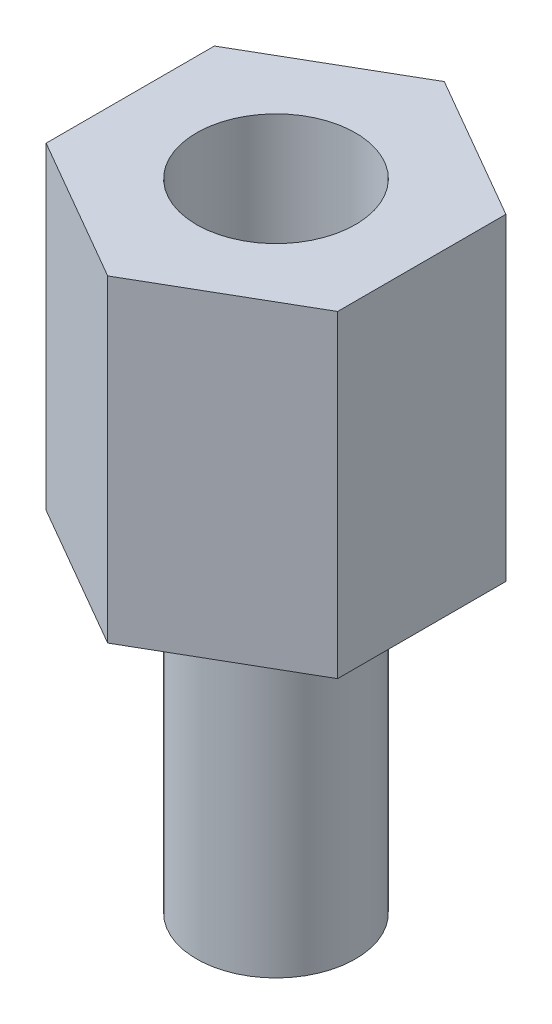
ISO-10303-21;
HEADER;
FILE_DESCRIPTION(('STEP AP214'),'2;1');
FILE_NAME('part.step','',(''),(''),'','','');
FILE_SCHEMA(('AUTOMOTIVE_DESIGN { 1 0 10303 214 1 1 1 1 }'));
ENDSEC;
DATA;
#1=APPLICATION_CONTEXT('core data for automotive mechanical design processes');
#2=APPLICATION_PROTOCOL_DEFINITION('international standard','automotive_design',2000,#1);
#3=PRODUCT_CONTEXT('',#1,'mechanical');
#4=PRODUCT('Part','Part','',(#3));
#5=PRODUCT_RELATED_PRODUCT_CATEGORY('part','',(#4));
#6=PRODUCT_DEFINITION_FORMATION('','',#4);
#7=PRODUCT_DEFINITION_CONTEXT('part definition',#1,'design');
#8=PRODUCT_DEFINITION('design','',#6,#7);
#9=PRODUCT_DEFINITION_SHAPE('','',#8);
#10=(LENGTH_UNIT() NAMED_UNIT(*) SI_UNIT(.MILLI.,.METRE.));
#11=(NAMED_UNIT(*) PLANE_ANGLE_UNIT() SI_UNIT($,.RADIAN.));
#12=(NAMED_UNIT(*) SI_UNIT($,.STERADIAN.) SOLID_ANGLE_UNIT());
#13=UNCERTAINTY_MEASURE_WITH_UNIT(LENGTH_MEASURE(1.E-05),#10,'distance_accuracy_value','');
#14=(GEOMETRIC_REPRESENTATION_CONTEXT(3) GLOBAL_UNCERTAINTY_ASSIGNED_CONTEXT((#13)) GLOBAL_UNIT_ASSIGNED_CONTEXT((#10,
#11,#12)) REPRESENTATION_CONTEXT('',''));
#15=CARTESIAN_POINT('',(0.,0.,0.));
#16=DIRECTION('',(0.,0.,1.));
#17=DIRECTION('',(1.,0.,0.));
#18=AXIS2_PLACEMENT_3D('',#15,#16,#17);
#19=CARTESIAN_POINT('',(2.74999999999998,6.,-1.5877132402715));
#20=DIRECTION('',(-0.499999999999995,0.,0.866025403784441));
#21=DIRECTION('',(0.866025403784441,0.,0.499999999999995));
#22=AXIS2_PLACEMENT_3D('',#19,#20,#21);
#23=PLANE('',#22);
#24=DIRECTION('',(-0.866025403784441,0.,-0.499999999999995));
#25=VECTOR('',#24,1.);
#26=CARTESIAN_POINT('',(2.74999999999998,0.,-1.5877132402715));
#27=LINE('',#26,#25);
#28=CARTESIAN_POINT('',(2.74999999999998,0.,-1.5877132402715));
#29=VERTEX_POINT('',#28);
#30=CARTESIAN_POINT('',(0.,0.,-3.17542648054294));
#31=VERTEX_POINT('',#30);
#32=EDGE_CURVE('E120',#29,#31,#27,.T.);
#33=ORIENTED_EDGE('',*,*,#32,.T.);
#34=DIRECTION('',(0.,-1.,0.));
#35=VECTOR('',#34,1.);
#36=CARTESIAN_POINT('',(0.,6.,-3.17542648054294));
#37=LINE('',#36,#35);
#38=CARTESIAN_POINT('',(0.,6.,-3.17542648054294));
#39=VERTEX_POINT('',#38);
#40=EDGE_CURVE('E37',#39,#31,#37,.T.);
#41=ORIENTED_EDGE('',*,*,#40,.F.);
#42=DIRECTION('',(-0.866025403784441,0.,-0.499999999999995));
#43=VECTOR('',#42,1.);
#44=CARTESIAN_POINT('',(2.74999999999998,6.,-1.5877132402715));
#45=LINE('',#44,#43);
#46=CARTESIAN_POINT('',(2.74999999999998,6.,-1.5877132402715));
#47=VERTEX_POINT('',#46);
#48=EDGE_CURVE('E131',#47,#39,#45,.T.);
#49=ORIENTED_EDGE('',*,*,#48,.F.);
#50=DIRECTION('',(0.,-1.,0.));
#51=VECTOR('',#50,1.);
#52=CARTESIAN_POINT('',(2.74999999999998,6.,-1.5877132402715));
#53=LINE('',#52,#51);
#54=EDGE_CURVE('E116',#47,#29,#53,.T.);
#55=ORIENTED_EDGE('',*,*,#54,.T.);
#56=EDGE_LOOP('',(#33,#41,#49,#55));
#57=FACE_BOUND('',#56,.T.);
#58=ADVANCED_FACE('F34',(#57),#23,.F.);
#59=CARTESIAN_POINT('',(0.,6.,-3.17542648054294));
#60=DIRECTION('',(0.500000000000001,0.,0.866025403784438));
#61=DIRECTION('',(0.866025403784438,0.,-0.500000000000001));
#62=AXIS2_PLACEMENT_3D('',#59,#60,#61);
#63=PLANE('',#62);
#64=DIRECTION('',(-0.866025403784438,0.,0.500000000000001));
#65=VECTOR('',#64,1.);
#66=CARTESIAN_POINT('',(0.,0.,-3.17542648054294));
#67=LINE('',#66,#65);
#68=CARTESIAN_POINT('',(-2.75,0.,-1.58771324027146));
#69=VERTEX_POINT('',#68);
#70=EDGE_CURVE('E123',#31,#69,#67,.T.);
#71=ORIENTED_EDGE('',*,*,#70,.T.);
#72=DIRECTION('',(0.,-1.,0.));
#73=VECTOR('',#72,1.);
#74=CARTESIAN_POINT('',(-2.75,6.,-1.58771324027146));
#75=LINE('',#74,#73);
#76=CARTESIAN_POINT('',(-2.75,6.,-1.58771324027146));
#77=VERTEX_POINT('',#76);
#78=EDGE_CURVE('E134',#77,#69,#75,.T.);
#79=ORIENTED_EDGE('',*,*,#78,.F.);
#80=DIRECTION('',(-0.866025403784438,0.,0.500000000000001));
#81=VECTOR('',#80,1.);
#82=CARTESIAN_POINT('',(0.,6.,-3.17542648054294));
#83=LINE('',#82,#81);
#84=EDGE_CURVE('E89',#39,#77,#83,.T.);
#85=ORIENTED_EDGE('',*,*,#84,.F.);
#86=ORIENTED_EDGE('',*,*,#40,.T.);
#87=EDGE_LOOP('',(#71,#79,#85,#86));
#88=FACE_BOUND('',#87,.T.);
#89=ADVANCED_FACE('F139',(#88),#63,.F.);
#90=CARTESIAN_POINT('',(-2.75,6.,-1.58771324027146));
#91=DIRECTION('',(1.,0.,0.));
#92=DIRECTION('',(0.,0.,-1.));
#93=AXIS2_PLACEMENT_3D('',#90,#91,#92);
#94=PLANE('',#93);
#95=DIRECTION('',(0.,0.,1.));
#96=VECTOR('',#95,1.);
#97=CARTESIAN_POINT('',(-2.75,0.,-1.58771324027146));
#98=LINE('',#97,#96);
#99=CARTESIAN_POINT('',(-2.74999999999999,0.,1.58771324027148));
#100=VERTEX_POINT('',#99);
#101=EDGE_CURVE('E126',#69,#100,#98,.T.);
#102=ORIENTED_EDGE('',*,*,#101,.T.);
#103=DIRECTION('',(0.,-1.,0.));
#104=VECTOR('',#103,1.);
#105=CARTESIAN_POINT('',(-2.74999999999999,6.,1.58771324027148));
#106=LINE('',#105,#104);
#107=CARTESIAN_POINT('',(-2.74999999999999,6.,1.58771324027148));
#108=VERTEX_POINT('',#107);
#109=EDGE_CURVE('E111',#108,#100,#106,.T.);
#110=ORIENTED_EDGE('',*,*,#109,.F.);
#111=DIRECTION('',(0.,0.,1.));
#112=VECTOR('',#111,1.);
#113=CARTESIAN_POINT('',(-2.75,6.,-1.58771324027146));
#114=LINE('',#113,#112);
#115=EDGE_CURVE('E102',#77,#108,#114,.T.);
#116=ORIENTED_EDGE('',*,*,#115,.F.);
#117=ORIENTED_EDGE('',*,*,#78,.T.);
#118=EDGE_LOOP('',(#102,#110,#116,#117));
#119=FACE_BOUND('',#118,.T.);
#120=ADVANCED_FACE('F145',(#119),#94,.F.);
#121=CARTESIAN_POINT('',(-2.74999999999999,6.,1.58771324027148));
#122=DIRECTION('',(0.499999999999995,0.,-0.866025403784441));
#123=DIRECTION('',(-0.866025403784442,0.,-0.499999999999995));
#124=AXIS2_PLACEMENT_3D('',#121,#122,#123);
#125=PLANE('',#124);
#126=DIRECTION('',(0.866025403784442,0.,0.499999999999995));
#127=VECTOR('',#126,1.);
#128=CARTESIAN_POINT('',(-2.74999999999999,0.,1.58771324027148));
#129=LINE('',#128,#127);
#130=CARTESIAN_POINT('',(0.,0.,3.17542648054294));
#131=VERTEX_POINT('',#130);
#132=EDGE_CURVE('E110',#100,#131,#129,.T.);
#133=ORIENTED_EDGE('',*,*,#132,.T.);
#134=DIRECTION('',(0.,-1.,0.));
#135=VECTOR('',#134,1.);
#136=CARTESIAN_POINT('',(0.,6.,3.17542648054294));
#137=LINE('',#136,#135);
#138=CARTESIAN_POINT('',(0.,6.,3.17542648054294));
#139=VERTEX_POINT('',#138);
#140=EDGE_CURVE('E107',#139,#131,#137,.T.);
#141=ORIENTED_EDGE('',*,*,#140,.F.);
#142=DIRECTION('',(0.866025403784442,0.,0.499999999999995));
#143=VECTOR('',#142,1.);
#144=CARTESIAN_POINT('',(-2.74999999999999,6.,1.58771324027148));
#145=LINE('',#144,#143);
#146=EDGE_CURVE('E96',#108,#139,#145,.T.);
#147=ORIENTED_EDGE('',*,*,#146,.F.);
#148=ORIENTED_EDGE('',*,*,#109,.T.);
#149=EDGE_LOOP('',(#133,#141,#147,#148));
#150=FACE_BOUND('',#149,.T.);
#151=ADVANCED_FACE('F108',(#150),#125,.F.);
#152=CARTESIAN_POINT('',(0.,6.,3.17542648054294));
#153=DIRECTION('',(-0.500000000000007,0.,-0.866025403784434));
#154=DIRECTION('',(-0.866025403784435,0.,0.500000000000007));
#155=AXIS2_PLACEMENT_3D('',#152,#153,#154);
#156=PLANE('',#155);
#157=DIRECTION('',(0.866025403784434,0.,-0.500000000000007));
#158=VECTOR('',#157,1.);
#159=CARTESIAN_POINT('',(0.,0.,3.17542648054294));
#160=LINE('',#159,#158);
#161=CARTESIAN_POINT('',(2.75000000000001,0.,1.58771324027144));
#162=VERTEX_POINT('',#161);
#163=EDGE_CURVE('E74',#131,#162,#160,.T.);
#164=ORIENTED_EDGE('',*,*,#163,.T.);
#165=DIRECTION('',(0.,-1.,0.));
#166=VECTOR('',#165,1.);
#167=CARTESIAN_POINT('',(2.75000000000001,6.,1.58771324027144));
#168=LINE('',#167,#166);
#169=CARTESIAN_POINT('',(2.75000000000001,6.,1.58771324027144));
#170=VERTEX_POINT('',#169);
#171=EDGE_CURVE('E112',#170,#162,#168,.T.);
#172=ORIENTED_EDGE('',*,*,#171,.F.);
#173=DIRECTION('',(0.866025403784434,0.,-0.500000000000007));
#174=VECTOR('',#173,1.);
#175=CARTESIAN_POINT('',(0.,6.,3.17542648054294));
#176=LINE('',#175,#174);
#177=EDGE_CURVE('E100',#139,#170,#176,.T.);
#178=ORIENTED_EDGE('',*,*,#177,.F.);
#179=ORIENTED_EDGE('',*,*,#140,.T.);
#180=EDGE_LOOP('',(#164,#172,#178,#179));
#181=FACE_BOUND('',#180,.T.);
#182=ADVANCED_FACE('F114',(#181),#156,.F.);
#183=CARTESIAN_POINT('',(2.75000000000001,6.,1.58771324027144));
#184=DIRECTION('',(-1.,0.,0.));
#185=DIRECTION('',(0.,0.,1.));
#186=AXIS2_PLACEMENT_3D('',#183,#184,#185);
#187=PLANE('',#186);
#188=DIRECTION('',(0.,0.,-1.));
#189=VECTOR('',#188,1.);
#190=CARTESIAN_POINT('',(2.75000000000001,0.,1.58771324027144));
#191=LINE('',#190,#189);
#192=EDGE_CURVE('E80',#162,#29,#191,.T.);
#193=ORIENTED_EDGE('',*,*,#192,.T.);
#194=ORIENTED_EDGE('',*,*,#54,.F.);
#195=DIRECTION('',(0.,0.,-1.));
#196=VECTOR('',#195,1.);
#197=CARTESIAN_POINT('',(2.75000000000001,6.,1.58771324027144));
#198=LINE('',#197,#196);
#199=EDGE_CURVE('E51',#170,#47,#198,.T.);
#200=ORIENTED_EDGE('',*,*,#199,.F.);
#201=ORIENTED_EDGE('',*,*,#171,.T.);
#202=EDGE_LOOP('',(#193,#194,#200,#201));
#203=FACE_BOUND('',#202,.T.);
#204=ADVANCED_FACE('F168',(#203),#187,.F.);
#205=CARTESIAN_POINT('',(0.,6.,0.));
#206=DIRECTION('',(0.,1.,0.));
#207=DIRECTION('',(0.,0.,1.));
#208=AXIS2_PLACEMENT_3D('',#205,#206,#207);
#209=PLANE('',#208);
#210=CARTESIAN_POINT('',(0.,6.,0.));
#211=DIRECTION('',(0.,1.,0.));
#212=DIRECTION('',(0.,0.,1.));
#213=AXIS2_PLACEMENT_3D('',#210,#211,#212);
#214=CIRCLE('',#213,1.5);
#215=CARTESIAN_POINT('',(0.,6.,1.5));
#216=VERTEX_POINT('',#215);
#217=EDGE_CURVE('E152',#216,#216,#214,.T.);
#218=ORIENTED_EDGE('',*,*,#217,.F.);
#219=EDGE_LOOP('',(#218));
#220=FACE_BOUND('',#219,.T.);
#221=ORIENTED_EDGE('',*,*,#48,.T.);
#222=ORIENTED_EDGE('',*,*,#84,.T.);
#223=ORIENTED_EDGE('',*,*,#115,.T.);
#224=ORIENTED_EDGE('',*,*,#146,.T.);
#225=ORIENTED_EDGE('',*,*,#177,.T.);
#226=ORIENTED_EDGE('',*,*,#199,.T.);
#227=EDGE_LOOP('',(#221,#222,#223,#224,#225,#226));
#228=FACE_BOUND('',#227,.T.);
#229=ADVANCED_FACE('F98',(#220,#228),#209,.T.);
#230=CARTESIAN_POINT('',(0.,0.,0.));
#231=DIRECTION('',(0.,1.,0.));
#232=DIRECTION('',(0.,0.,1.));
#233=AXIS2_PLACEMENT_3D('',#230,#231,#232);
#234=PLANE('',#233);
#235=CARTESIAN_POINT('',(0.,0.,0.));
#236=DIRECTION('',(0.,-1.,0.));
#237=DIRECTION('',(0.,0.,-1.));
#238=AXIS2_PLACEMENT_3D('',#235,#236,#237);
#239=CIRCLE('',#238,1.5);
#240=CARTESIAN_POINT('',(0.,0.,-1.5));
#241=VERTEX_POINT('',#240);
#242=EDGE_CURVE('E11',#241,#241,#239,.T.);
#243=ORIENTED_EDGE('',*,*,#242,.F.);
#244=EDGE_LOOP('',(#243));
#245=FACE_BOUND('',#244,.T.);
#246=ORIENTED_EDGE('',*,*,#32,.F.);
#247=ORIENTED_EDGE('',*,*,#192,.F.);
#248=ORIENTED_EDGE('',*,*,#163,.F.);
#249=ORIENTED_EDGE('',*,*,#132,.F.);
#250=ORIENTED_EDGE('',*,*,#101,.F.);
#251=ORIENTED_EDGE('',*,*,#70,.F.);
#252=EDGE_LOOP('',(#246,#247,#248,#249,#250,#251));
#253=FACE_BOUND('',#252,.T.);
#254=ADVANCED_FACE('F144',(#245,#253),#234,.F.);
#255=CARTESIAN_POINT('',(0.,-6.,0.));
#256=DIRECTION('',(0.,1.,0.));
#257=DIRECTION('',(0.,0.,1.));
#258=AXIS2_PLACEMENT_3D('',#255,#256,#257);
#259=CYLINDRICAL_SURFACE('',#258,1.5);
#260=CARTESIAN_POINT('',(0.,-6.,0.));
#261=DIRECTION('',(0.,-1.,0.));
#262=DIRECTION('',(0.,0.,-1.));
#263=AXIS2_PLACEMENT_3D('',#260,#261,#262);
#264=CIRCLE('',#263,1.5);
#265=CARTESIAN_POINT('',(0.,-6.,-1.5));
#266=VERTEX_POINT('',#265);
#267=EDGE_CURVE('E124',#266,#266,#264,.T.);
#268=ORIENTED_EDGE('',*,*,#267,.F.);
#269=EDGE_LOOP('',(#268));
#270=FACE_BOUND('',#269,.T.);
#271=ORIENTED_EDGE('',*,*,#242,.T.);
#272=EDGE_LOOP('',(#271));
#273=FACE_BOUND('',#272,.T.);
#274=ADVANCED_FACE('F174',(#270,#273),#259,.T.);
#275=CARTESIAN_POINT('',(0.,-6.,0.));
#276=DIRECTION('',(0.,-1.,0.));
#277=DIRECTION('',(0.,0.,-1.));
#278=AXIS2_PLACEMENT_3D('',#275,#276,#277);
#279=PLANE('',#278);
#280=ORIENTED_EDGE('',*,*,#267,.T.);
#281=EDGE_LOOP('',(#280));
#282=FACE_BOUND('',#281,.T.);
#283=ADVANCED_FACE('F163',(#282),#279,.T.);
#284=CARTESIAN_POINT('',(0.,0.5,0.));
#285=DIRECTION('',(0.,1.,0.));
#286=DIRECTION('',(0.,0.,1.));
#287=AXIS2_PLACEMENT_3D('',#284,#285,#286);
#288=CYLINDRICAL_SURFACE('',#287,1.5);
#289=CARTESIAN_POINT('',(0.,0.5,0.));
#290=DIRECTION('',(0.,1.,0.));
#291=DIRECTION('',(0.,0.,1.));
#292=AXIS2_PLACEMENT_3D('',#289,#290,#291);
#293=CIRCLE('',#292,1.5);
#294=CARTESIAN_POINT('',(0.,0.5,1.5));
#295=VERTEX_POINT('',#294);
#296=EDGE_CURVE('E151',#295,#295,#293,.T.);
#297=ORIENTED_EDGE('',*,*,#296,.F.);
#298=EDGE_LOOP('',(#297));
#299=FACE_BOUND('',#298,.T.);
#300=ORIENTED_EDGE('',*,*,#217,.T.);
#301=EDGE_LOOP('',(#300));
#302=FACE_BOUND('',#301,.T.);
#303=ADVANCED_FACE('F160',(#299,#302),#288,.F.);
#304=CARTESIAN_POINT('',(0.,0.5,0.));
#305=DIRECTION('',(0.,1.,0.));
#306=DIRECTION('',(0.,0.,1.));
#307=AXIS2_PLACEMENT_3D('',#304,#305,#306);
#308=PLANE('',#307);
#309=ORIENTED_EDGE('',*,*,#296,.T.);
#310=EDGE_LOOP('',(#309));
#311=FACE_BOUND('',#310,.T.);
#312=ADVANCED_FACE('F158',(#311),#308,.T.);
#313=CLOSED_SHELL('',(#58,#89,#120,#151,#182,#204,#229,#254,#274,#283,#303,#312));
#314=MANIFOLD_SOLID_BREP('B2',#313);
#315=ADVANCED_BREP_SHAPE_REPRESENTATION('',(#18,#314),#14);
#316=SHAPE_DEFINITION_REPRESENTATION(#9,#315);
ENDSEC;
END-ISO-10303-21;
